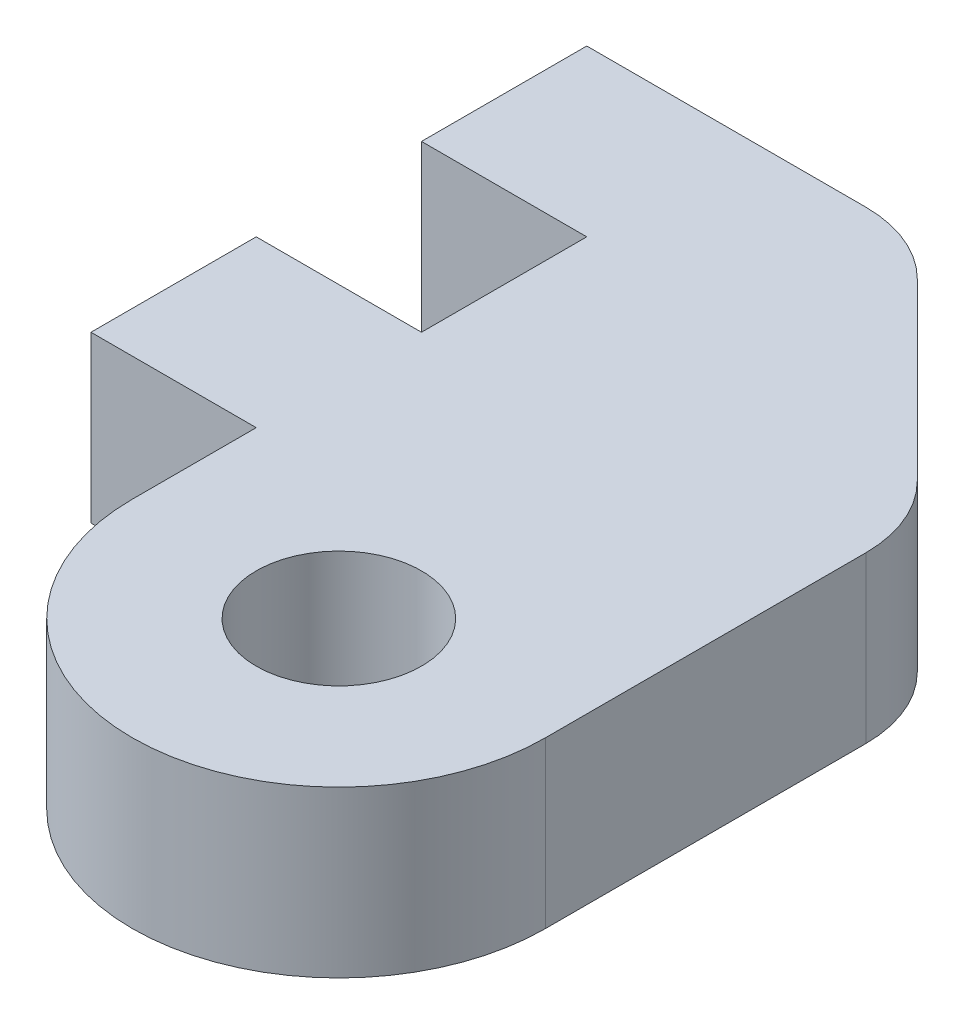
ISO-10303-21;
HEADER;
FILE_DESCRIPTION(('STEP AP214'),'2;1');
FILE_NAME('part.step','',(''),(''),'','','');
FILE_SCHEMA(('AUTOMOTIVE_DESIGN { 1 0 10303 214 1 1 1 1 }'));
ENDSEC;
DATA;
#1=APPLICATION_CONTEXT('core data for automotive mechanical design processes');
#2=APPLICATION_PROTOCOL_DEFINITION('international standard','automotive_design',2000,#1);
#3=PRODUCT_CONTEXT('',#1,'mechanical');
#4=PRODUCT('Part','Part','',(#3));
#5=PRODUCT_RELATED_PRODUCT_CATEGORY('part','',(#4));
#6=PRODUCT_DEFINITION_FORMATION('','',#4);
#7=PRODUCT_DEFINITION_CONTEXT('part definition',#1,'design');
#8=PRODUCT_DEFINITION('design','',#6,#7);
#9=PRODUCT_DEFINITION_SHAPE('','',#8);
#10=(LENGTH_UNIT() NAMED_UNIT(*) SI_UNIT(.MILLI.,.METRE.));
#11=(NAMED_UNIT(*) PLANE_ANGLE_UNIT() SI_UNIT($,.RADIAN.));
#12=(NAMED_UNIT(*) SI_UNIT($,.STERADIAN.) SOLID_ANGLE_UNIT());
#13=UNCERTAINTY_MEASURE_WITH_UNIT(LENGTH_MEASURE(1.E-05),#10,'distance_accuracy_value','');
#14=(GEOMETRIC_REPRESENTATION_CONTEXT(3) GLOBAL_UNCERTAINTY_ASSIGNED_CONTEXT((#13)) GLOBAL_UNIT_ASSIGNED_CONTEXT((#10,
#11,#12)) REPRESENTATION_CONTEXT('',''));
#15=CARTESIAN_POINT('',(0.,0.,0.));
#16=DIRECTION('',(0.,0.,1.));
#17=DIRECTION('',(1.,0.,0.));
#18=AXIS2_PLACEMENT_3D('',#15,#16,#17);
#19=CARTESIAN_POINT('',(0.,4.,-15.));
#20=DIRECTION('',(0.,0.,1.));
#21=DIRECTION('',(1.,0.,0.));
#22=AXIS2_PLACEMENT_3D('',#19,#20,#21);
#23=PLANE('',#22);
#24=DIRECTION('',(-1.,0.,0.));
#25=VECTOR('',#24,1.);
#26=CARTESIAN_POINT('',(0.,4.,-15.));
#27=LINE('',#26,#25);
#28=CARTESIAN_POINT('',(-2.24264068711929,4.,-15.));
#29=VERTEX_POINT('',#28);
#30=CARTESIAN_POINT('',(-9.,4.,-15.));
#31=VERTEX_POINT('',#30);
#32=EDGE_CURVE('E131',#29,#31,#27,.T.);
#33=ORIENTED_EDGE('',*,*,#32,.F.);
#34=DIRECTION('',(0.,1.,0.));
#35=VECTOR('',#34,1.);
#36=CARTESIAN_POINT('',(-2.24264068711929,0.,-15.));
#37=LINE('',#36,#35);
#38=CARTESIAN_POINT('',(-2.24264068711929,0.,-15.));
#39=VERTEX_POINT('',#38);
#40=EDGE_CURVE('E11',#29,#39,#37,.F.);
#41=ORIENTED_EDGE('',*,*,#40,.T.);
#42=DIRECTION('',(-1.,0.,0.));
#43=VECTOR('',#42,1.);
#44=CARTESIAN_POINT('',(0.,0.,-15.));
#45=LINE('',#44,#43);
#46=CARTESIAN_POINT('',(-9.,0.,-15.));
#47=VERTEX_POINT('',#46);
#48=EDGE_CURVE('E155',#39,#47,#45,.T.);
#49=ORIENTED_EDGE('',*,*,#48,.T.);
#50=DIRECTION('',(0.,-1.,0.));
#51=VECTOR('',#50,1.);
#52=CARTESIAN_POINT('',(-9.,4.,-15.));
#53=LINE('',#52,#51);
#54=EDGE_CURVE('E149',#31,#47,#53,.T.);
#55=ORIENTED_EDGE('',*,*,#54,.F.);
#56=EDGE_LOOP('',(#33,#41,#49,#55));
#57=FACE_BOUND('',#56,.T.);
#58=ADVANCED_FACE('F35',(#57),#23,.F.);
#59=CARTESIAN_POINT('',(-9.,4.,0.));
#60=DIRECTION('',(1.,0.,0.));
#61=DIRECTION('',(0.,0.,-1.));
#62=AXIS2_PLACEMENT_3D('',#59,#60,#61);
#63=PLANE('',#62);
#64=DIRECTION('',(0.,0.,1.));
#65=VECTOR('',#64,1.);
#66=CARTESIAN_POINT('',(-9.,0.,0.));
#67=LINE('',#66,#65);
#68=CARTESIAN_POINT('',(-9.,0.,-11.));
#69=VERTEX_POINT('',#68);
#70=EDGE_CURVE('E196',#47,#69,#67,.T.);
#71=ORIENTED_EDGE('',*,*,#70,.T.);
#72=DIRECTION('',(0.,-1.,0.));
#73=VECTOR('',#72,1.);
#74=CARTESIAN_POINT('',(-9.,4.,-11.));
#75=LINE('',#74,#73);
#76=CARTESIAN_POINT('',(-9.,4.,-11.));
#77=VERTEX_POINT('',#76);
#78=EDGE_CURVE('E150',#77,#69,#75,.T.);
#79=ORIENTED_EDGE('',*,*,#78,.F.);
#80=DIRECTION('',(0.,0.,1.));
#81=VECTOR('',#80,1.);
#82=CARTESIAN_POINT('',(-9.,4.,0.));
#83=LINE('',#82,#81);
#84=EDGE_CURVE('E136',#31,#77,#83,.T.);
#85=ORIENTED_EDGE('',*,*,#84,.F.);
#86=ORIENTED_EDGE('',*,*,#54,.T.);
#87=EDGE_LOOP('',(#71,#79,#85,#86));
#88=FACE_BOUND('',#87,.T.);
#89=ADVANCED_FACE('F148',(#88),#63,.F.);
#90=CARTESIAN_POINT('',(0.,4.,-11.));
#91=DIRECTION('',(0.,0.,1.));
#92=DIRECTION('',(1.,0.,0.));
#93=AXIS2_PLACEMENT_3D('',#90,#91,#92);
#94=PLANE('',#93);
#95=DIRECTION('',(-1.,0.,0.));
#96=VECTOR('',#95,1.);
#97=CARTESIAN_POINT('',(0.,0.,-11.));
#98=LINE('',#97,#96);
#99=CARTESIAN_POINT('',(-5.,0.,-11.));
#100=VERTEX_POINT('',#99);
#101=EDGE_CURVE('E199',#100,#69,#98,.T.);
#102=ORIENTED_EDGE('',*,*,#101,.F.);
#103=DIRECTION('',(0.,-1.,0.));
#104=VECTOR('',#103,1.);
#105=CARTESIAN_POINT('',(-5.,4.,-11.));
#106=LINE('',#105,#104);
#107=CARTESIAN_POINT('',(-5.,4.,-11.));
#108=VERTEX_POINT('',#107);
#109=EDGE_CURVE('E161',#108,#100,#106,.T.);
#110=ORIENTED_EDGE('',*,*,#109,.F.);
#111=DIRECTION('',(-1.,0.,0.));
#112=VECTOR('',#111,1.);
#113=CARTESIAN_POINT('',(0.,4.,-11.));
#114=LINE('',#113,#112);
#115=EDGE_CURVE('E152',#108,#77,#114,.T.);
#116=ORIENTED_EDGE('',*,*,#115,.T.);
#117=ORIENTED_EDGE('',*,*,#78,.T.);
#118=EDGE_LOOP('',(#102,#110,#116,#117));
#119=FACE_BOUND('',#118,.T.);
#120=ADVANCED_FACE('F238',(#119),#94,.T.);
#121=CARTESIAN_POINT('',(-5.,4.,0.));
#122=DIRECTION('',(-1.,0.,0.));
#123=DIRECTION('',(0.,0.,1.));
#124=AXIS2_PLACEMENT_3D('',#121,#122,#123);
#125=PLANE('',#124);
#126=DIRECTION('',(0.,0.,-1.));
#127=VECTOR('',#126,1.);
#128=CARTESIAN_POINT('',(-5.,0.,0.));
#129=LINE('',#128,#127);
#130=CARTESIAN_POINT('',(-5.,0.,-7.));
#131=VERTEX_POINT('',#130);
#132=EDGE_CURVE('E206',#131,#100,#129,.T.);
#133=ORIENTED_EDGE('',*,*,#132,.F.);
#134=DIRECTION('',(0.,-1.,0.));
#135=VECTOR('',#134,1.);
#136=CARTESIAN_POINT('',(-5.,4.,-7.));
#137=LINE('',#136,#135);
#138=CARTESIAN_POINT('',(-5.,4.,-7.));
#139=VERTEX_POINT('',#138);
#140=EDGE_CURVE('E229',#139,#131,#137,.T.);
#141=ORIENTED_EDGE('',*,*,#140,.F.);
#142=DIRECTION('',(0.,0.,-1.));
#143=VECTOR('',#142,1.);
#144=CARTESIAN_POINT('',(-5.,4.,0.));
#145=LINE('',#144,#143);
#146=EDGE_CURVE('E236',#139,#108,#145,.T.);
#147=ORIENTED_EDGE('',*,*,#146,.T.);
#148=ORIENTED_EDGE('',*,*,#109,.T.);
#149=EDGE_LOOP('',(#133,#141,#147,#148));
#150=FACE_BOUND('',#149,.T.);
#151=ADVANCED_FACE('F234',(#150),#125,.T.);
#152=CARTESIAN_POINT('',(0.,4.,-7.));
#153=DIRECTION('',(0.,0.,1.));
#154=DIRECTION('',(1.,0.,0.));
#155=AXIS2_PLACEMENT_3D('',#152,#153,#154);
#156=PLANE('',#155);
#157=DIRECTION('',(-1.,0.,0.));
#158=VECTOR('',#157,1.);
#159=CARTESIAN_POINT('',(0.,0.,-7.));
#160=LINE('',#159,#158);
#161=CARTESIAN_POINT('',(-9.,0.,-7.));
#162=VERTEX_POINT('',#161);
#163=EDGE_CURVE('E209',#131,#162,#160,.T.);
#164=ORIENTED_EDGE('',*,*,#163,.T.);
#165=DIRECTION('',(0.,-1.,0.));
#166=VECTOR('',#165,1.);
#167=CARTESIAN_POINT('',(-9.,4.,-7.));
#168=LINE('',#167,#166);
#169=CARTESIAN_POINT('',(-9.,4.,-7.));
#170=VERTEX_POINT('',#169);
#171=EDGE_CURVE('E226',#170,#162,#168,.T.);
#172=ORIENTED_EDGE('',*,*,#171,.F.);
#173=DIRECTION('',(-1.,0.,0.));
#174=VECTOR('',#173,1.);
#175=CARTESIAN_POINT('',(0.,4.,-7.));
#176=LINE('',#175,#174);
#177=EDGE_CURVE('E253',#139,#170,#176,.T.);
#178=ORIENTED_EDGE('',*,*,#177,.F.);
#179=ORIENTED_EDGE('',*,*,#140,.T.);
#180=EDGE_LOOP('',(#164,#172,#178,#179));
#181=FACE_BOUND('',#180,.T.);
#182=ADVANCED_FACE('F243',(#181),#156,.F.);
#183=CARTESIAN_POINT('',(-9.,4.,0.));
#184=DIRECTION('',(1.,0.,0.));
#185=DIRECTION('',(0.,0.,-1.));
#186=AXIS2_PLACEMENT_3D('',#183,#184,#185);
#187=PLANE('',#186);
#188=DIRECTION('',(0.,0.,1.));
#189=VECTOR('',#188,1.);
#190=CARTESIAN_POINT('',(-9.,0.,0.));
#191=LINE('',#190,#189);
#192=CARTESIAN_POINT('',(-9.,0.,-3.));
#193=VERTEX_POINT('',#192);
#194=EDGE_CURVE('E212',#162,#193,#191,.T.);
#195=ORIENTED_EDGE('',*,*,#194,.T.);
#196=DIRECTION('',(0.,-1.,0.));
#197=VECTOR('',#196,1.);
#198=CARTESIAN_POINT('',(-9.,4.,-3.));
#199=LINE('',#198,#197);
#200=CARTESIAN_POINT('',(-9.,4.,-3.));
#201=VERTEX_POINT('',#200);
#202=EDGE_CURVE('E224',#201,#193,#199,.T.);
#203=ORIENTED_EDGE('',*,*,#202,.F.);
#204=DIRECTION('',(0.,0.,1.));
#205=VECTOR('',#204,1.);
#206=CARTESIAN_POINT('',(-9.,4.,0.));
#207=LINE('',#206,#205);
#208=EDGE_CURVE('E249',#170,#201,#207,.T.);
#209=ORIENTED_EDGE('',*,*,#208,.F.);
#210=ORIENTED_EDGE('',*,*,#171,.T.);
#211=EDGE_LOOP('',(#195,#203,#209,#210));
#212=FACE_BOUND('',#211,.T.);
#213=ADVANCED_FACE('F247',(#212),#187,.F.);
#214=CARTESIAN_POINT('',(0.,4.,-3.));
#215=DIRECTION('',(0.,0.,1.));
#216=DIRECTION('',(1.,0.,0.));
#217=AXIS2_PLACEMENT_3D('',#214,#215,#216);
#218=PLANE('',#217);
#219=DIRECTION('',(-1.,0.,0.));
#220=VECTOR('',#219,1.);
#221=CARTESIAN_POINT('',(0.,0.,-3.));
#222=LINE('',#221,#220);
#223=CARTESIAN_POINT('',(-5.,0.,-3.));
#224=VERTEX_POINT('',#223);
#225=EDGE_CURVE('E215',#224,#193,#222,.T.);
#226=ORIENTED_EDGE('',*,*,#225,.F.);
#227=DIRECTION('',(0.,-1.,0.));
#228=VECTOR('',#227,1.);
#229=CARTESIAN_POINT('',(-5.,4.,-3.));
#230=LINE('',#229,#228);
#231=CARTESIAN_POINT('',(-5.,4.,-3.));
#232=VERTEX_POINT('',#231);
#233=EDGE_CURVE('E222',#232,#224,#230,.T.);
#234=ORIENTED_EDGE('',*,*,#233,.F.);
#235=DIRECTION('',(-1.,0.,0.));
#236=VECTOR('',#235,1.);
#237=CARTESIAN_POINT('',(0.,4.,-3.));
#238=LINE('',#237,#236);
#239=EDGE_CURVE('E252',#232,#201,#238,.T.);
#240=ORIENTED_EDGE('',*,*,#239,.T.);
#241=ORIENTED_EDGE('',*,*,#202,.T.);
#242=EDGE_LOOP('',(#226,#234,#240,#241));
#243=FACE_BOUND('',#242,.T.);
#244=ADVANCED_FACE('F364',(#243),#218,.T.);
#245=CARTESIAN_POINT('',(-5.,0.,0.));
#246=VERTEX_POINT('',#245);
#247=EDGE_CURVE('E210',#246,#224,#129,.T.);
#248=ORIENTED_EDGE('',*,*,#247,.F.);
#249=DIRECTION('',(0.,-1.,0.));
#250=VECTOR('',#249,1.);
#251=CARTESIAN_POINT('',(-5.,4.,0.));
#252=LINE('',#251,#250);
#253=CARTESIAN_POINT('',(-5.,4.,0.));
#254=VERTEX_POINT('',#253);
#255=EDGE_CURVE('E220',#254,#246,#252,.T.);
#256=ORIENTED_EDGE('',*,*,#255,.F.);
#257=EDGE_CURVE('E255',#254,#232,#145,.T.);
#258=ORIENTED_EDGE('',*,*,#257,.T.);
#259=ORIENTED_EDGE('',*,*,#233,.T.);
#260=EDGE_LOOP('',(#248,#256,#258,#259));
#261=FACE_BOUND('',#260,.T.);
#262=ADVANCED_FACE('F354',(#261),#125,.T.);
#263=CARTESIAN_POINT('',(0.,4.,0.));
#264=DIRECTION('',(0.,-1.,0.));
#265=DIRECTION('',(0.,0.,-1.));
#266=AXIS2_PLACEMENT_3D('',#263,#264,#265);
#267=CYLINDRICAL_SURFACE('',#266,5.);
#268=CARTESIAN_POINT('',(0.,0.,0.));
#269=DIRECTION('',(0.,1.,0.));
#270=DIRECTION('',(0.,0.,1.));
#271=AXIS2_PLACEMENT_3D('',#268,#269,#270);
#272=CIRCLE('',#271,5.);
#273=CARTESIAN_POINT('',(5.,0.,0.));
#274=VERTEX_POINT('',#273);
#275=EDGE_CURVE('E190',#246,#274,#272,.T.);
#276=ORIENTED_EDGE('',*,*,#275,.T.);
#277=DIRECTION('',(0.,-1.,0.));
#278=VECTOR('',#277,1.);
#279=CARTESIAN_POINT('',(5.,4.,0.));
#280=LINE('',#279,#278);
#281=CARTESIAN_POINT('',(5.,4.,0.));
#282=VERTEX_POINT('',#281);
#283=EDGE_CURVE('E189',#282,#274,#280,.T.);
#284=ORIENTED_EDGE('',*,*,#283,.F.);
#285=CARTESIAN_POINT('',(0.,4.,0.));
#286=DIRECTION('',(0.,1.,0.));
#287=DIRECTION('',(0.,0.,1.));
#288=AXIS2_PLACEMENT_3D('',#285,#286,#287);
#289=CIRCLE('',#288,5.);
#290=EDGE_CURVE('E260',#254,#282,#289,.T.);
#291=ORIENTED_EDGE('',*,*,#290,.F.);
#292=ORIENTED_EDGE('',*,*,#255,.T.);
#293=EDGE_LOOP('',(#276,#284,#291,#292));
#294=FACE_BOUND('',#293,.T.);
#295=ADVANCED_FACE('F292',(#294),#267,.T.);
#296=CARTESIAN_POINT('',(0.,4.,0.));
#297=DIRECTION('',(0.,-1.,0.));
#298=DIRECTION('',(0.,0.,-1.));
#299=AXIS2_PLACEMENT_3D('',#296,#297,#298);
#300=CYLINDRICAL_SURFACE('',#299,2.);
#301=CARTESIAN_POINT('',(0.,4.,0.));
#302=DIRECTION('',(0.,1.,0.));
#303=DIRECTION('',(0.,0.,1.));
#304=AXIS2_PLACEMENT_3D('',#301,#302,#303);
#305=CIRCLE('',#304,2.);
#306=CARTESIAN_POINT('',(0.,4.,2.));
#307=VERTEX_POINT('',#306);
#308=EDGE_CURVE('E143',#307,#307,#305,.T.);
#309=ORIENTED_EDGE('',*,*,#308,.T.);
#310=EDGE_LOOP('',(#309));
#311=FACE_BOUND('',#310,.T.);
#312=CARTESIAN_POINT('',(0.,0.,0.));
#313=DIRECTION('',(0.,1.,0.));
#314=DIRECTION('',(0.,0.,1.));
#315=AXIS2_PLACEMENT_3D('',#312,#313,#314);
#316=CIRCLE('',#315,2.);
#317=CARTESIAN_POINT('',(0.,0.,2.));
#318=VERTEX_POINT('',#317);
#319=EDGE_CURVE('E197',#318,#318,#316,.T.);
#320=ORIENTED_EDGE('',*,*,#319,.F.);
#321=EDGE_LOOP('',(#320));
#322=FACE_BOUND('',#321,.T.);
#323=ADVANCED_FACE('F270',(#311,#322),#300,.F.);
#324=CARTESIAN_POINT('',(5.,4.,0.));
#325=DIRECTION('',(-1.,0.,0.));
#326=DIRECTION('',(0.,0.,1.));
#327=AXIS2_PLACEMENT_3D('',#324,#325,#326);
#328=PLANE('',#327);
#329=DIRECTION('',(0.,0.,-1.));
#330=VECTOR('',#329,1.);
#331=CARTESIAN_POINT('',(5.,0.,0.));
#332=LINE('',#331,#330);
#333=CARTESIAN_POINT('',(5.,0.,-7.7573593128807));
#334=VERTEX_POINT('',#333);
#335=EDGE_CURVE('E181',#274,#334,#332,.T.);
#336=ORIENTED_EDGE('',*,*,#335,.T.);
#337=DIRECTION('',(0.,-1.,0.));
#338=VECTOR('',#337,1.);
#339=CARTESIAN_POINT('',(5.,4.,-7.7573593128807));
#340=LINE('',#339,#338);
#341=CARTESIAN_POINT('',(5.,4.,-7.7573593128807));
#342=VERTEX_POINT('',#341);
#343=EDGE_CURVE('E166',#334,#342,#340,.F.);
#344=ORIENTED_EDGE('',*,*,#343,.T.);
#345=DIRECTION('',(0.,0.,-1.));
#346=VECTOR('',#345,1.);
#347=CARTESIAN_POINT('',(5.,4.,0.));
#348=LINE('',#347,#346);
#349=EDGE_CURVE('E193',#282,#342,#348,.T.);
#350=ORIENTED_EDGE('',*,*,#349,.F.);
#351=ORIENTED_EDGE('',*,*,#283,.T.);
#352=EDGE_LOOP('',(#336,#344,#350,#351));
#353=FACE_BOUND('',#352,.T.);
#354=ADVANCED_FACE('F186',(#353),#328,.F.);
#355=CARTESIAN_POINT('',(0.,4.,0.));
#356=DIRECTION('',(0.,1.,0.));
#357=DIRECTION('',(0.,0.,1.));
#358=AXIS2_PLACEMENT_3D('',#355,#356,#357);
#359=PLANE('',#358);
#360=ORIENTED_EDGE('',*,*,#308,.F.);
#361=EDGE_LOOP('',(#360));
#362=FACE_BOUND('',#361,.T.);
#363=ORIENTED_EDGE('',*,*,#349,.T.);
#364=CARTESIAN_POINT('',(2.,4.,-7.7573593128807));
#365=DIRECTION('',(0.,1.,0.));
#366=DIRECTION('',(0.,0.,1.));
#367=AXIS2_PLACEMENT_3D('',#364,#365,#366);
#368=CIRCLE('',#367,3.);
#369=CARTESIAN_POINT('',(4.12132034355965,4.,-9.87867965644034));
#370=VERTEX_POINT('',#369);
#371=EDGE_CURVE('E170',#342,#370,#368,.T.);
#372=ORIENTED_EDGE('',*,*,#371,.T.);
#373=DIRECTION('',(0.707106781186546,0.,0.707106781186549));
#374=VECTOR('',#373,1.);
#375=CARTESIAN_POINT('',(7.,4.,-6.99999999999997));
#376=LINE('',#375,#374);
#377=CARTESIAN_POINT('',(-0.121320343559639,4.,-14.1213203435596));
#378=VERTEX_POINT('',#377);
#379=EDGE_CURVE('E159',#370,#378,#376,.F.);
#380=ORIENTED_EDGE('',*,*,#379,.T.);
#381=CARTESIAN_POINT('',(-2.24264068711929,4.,-12.));
#382=DIRECTION('',(0.,1.,0.));
#383=DIRECTION('',(0.,0.,1.));
#384=AXIS2_PLACEMENT_3D('',#381,#382,#383);
#385=CIRCLE('',#384,3.);
#386=EDGE_CURVE('E140',#378,#29,#385,.T.);
#387=ORIENTED_EDGE('',*,*,#386,.T.);
#388=ORIENTED_EDGE('',*,*,#32,.T.);
#389=ORIENTED_EDGE('',*,*,#84,.T.);
#390=ORIENTED_EDGE('',*,*,#115,.F.);
#391=ORIENTED_EDGE('',*,*,#146,.F.);
#392=ORIENTED_EDGE('',*,*,#177,.T.);
#393=ORIENTED_EDGE('',*,*,#208,.T.);
#394=ORIENTED_EDGE('',*,*,#239,.F.);
#395=ORIENTED_EDGE('',*,*,#257,.F.);
#396=ORIENTED_EDGE('',*,*,#290,.T.);
#397=EDGE_LOOP('',(#363,#372,#380,#387,#388,#389,#390,#391,#392,#393,#394,#395,#396));
#398=FACE_BOUND('',#397,.T.);
#399=ADVANCED_FACE('F134',(#362,#398),#359,.T.);
#400=CARTESIAN_POINT('',(0.,0.,0.));
#401=DIRECTION('',(0.,1.,0.));
#402=DIRECTION('',(0.,0.,1.));
#403=AXIS2_PLACEMENT_3D('',#400,#401,#402);
#404=PLANE('',#403);
#405=ORIENTED_EDGE('',*,*,#319,.T.);
#406=EDGE_LOOP('',(#405));
#407=FACE_BOUND('',#406,.T.);
#408=DIRECTION('',(-0.707106781186546,0.,-0.707106781186549));
#409=VECTOR('',#408,1.);
#410=CARTESIAN_POINT('',(-0.999999999999995,0.,-15.));
#411=LINE('',#410,#409);
#412=CARTESIAN_POINT('',(-0.121320343559637,0.,-14.1213203435596));
#413=VERTEX_POINT('',#412);
#414=CARTESIAN_POINT('',(4.12132034355965,0.,-9.87867965644033));
#415=VERTEX_POINT('',#414);
#416=EDGE_CURVE('E157',#413,#415,#411,.F.);
#417=ORIENTED_EDGE('',*,*,#416,.T.);
#418=CARTESIAN_POINT('',(2.,0.,-7.7573593128807));
#419=DIRECTION('',(0.,1.,0.));
#420=DIRECTION('',(0.,0.,1.));
#421=AXIS2_PLACEMENT_3D('',#418,#419,#420);
#422=CIRCLE('',#421,3.);
#423=EDGE_CURVE('E43',#415,#334,#422,.F.);
#424=ORIENTED_EDGE('',*,*,#423,.T.);
#425=ORIENTED_EDGE('',*,*,#335,.F.);
#426=ORIENTED_EDGE('',*,*,#275,.F.);
#427=ORIENTED_EDGE('',*,*,#247,.T.);
#428=ORIENTED_EDGE('',*,*,#225,.T.);
#429=ORIENTED_EDGE('',*,*,#194,.F.);
#430=ORIENTED_EDGE('',*,*,#163,.F.);
#431=ORIENTED_EDGE('',*,*,#132,.T.);
#432=ORIENTED_EDGE('',*,*,#101,.T.);
#433=ORIENTED_EDGE('',*,*,#70,.F.);
#434=ORIENTED_EDGE('',*,*,#48,.F.);
#435=CARTESIAN_POINT('',(-2.24264068711929,0.,-12.));
#436=DIRECTION('',(0.,1.,0.));
#437=DIRECTION('',(0.,0.,1.));
#438=AXIS2_PLACEMENT_3D('',#435,#436,#437);
#439=CIRCLE('',#438,3.);
#440=EDGE_CURVE('E50',#39,#413,#439,.F.);
#441=ORIENTED_EDGE('',*,*,#440,.T.);
#442=EDGE_LOOP('',(#417,#424,#425,#426,#427,#428,#429,#430,#431,#432,#433,#434,#441));
#443=FACE_BOUND('',#442,.T.);
#444=ADVANCED_FACE('F179',(#407,#443),#404,.F.);
#445=CARTESIAN_POINT('',(-0.999999999999995,4.,-15.));
#446=DIRECTION('',(-0.707106781186549,0.,0.707106781186546));
#447=DIRECTION('',(0.,-1.,0.));
#448=AXIS2_PLACEMENT_3D('',#445,#446,#447);
#449=PLANE('',#448);
#450=ORIENTED_EDGE('',*,*,#379,.F.);
#451=DIRECTION('',(0.,1.,0.));
#452=VECTOR('',#451,1.);
#453=CARTESIAN_POINT('',(4.12132034355965,0.,-9.87867965644034));
#454=LINE('',#453,#452);
#455=EDGE_CURVE('E57',#370,#415,#454,.F.);
#456=ORIENTED_EDGE('',*,*,#455,.T.);
#457=ORIENTED_EDGE('',*,*,#416,.F.);
#458=DIRECTION('',(0.,-1.,0.));
#459=VECTOR('',#458,1.);
#460=CARTESIAN_POINT('',(-0.121320343559638,4.,-14.1213203435596));
#461=LINE('',#460,#459);
#462=EDGE_CURVE('E172',#413,#378,#461,.F.);
#463=ORIENTED_EDGE('',*,*,#462,.T.);
#464=EDGE_LOOP('',(#450,#456,#457,#463));
#465=FACE_BOUND('',#464,.T.);
#466=ADVANCED_FACE('F194',(#465),#449,.F.);
#467=CARTESIAN_POINT('',(2.,4.,-7.7573593128807));
#468=DIRECTION('',(0.,1.,0.));
#469=DIRECTION('',(0.,0.,1.));
#470=AXIS2_PLACEMENT_3D('',#467,#468,#469);
#471=CYLINDRICAL_SURFACE('',#470,3.);
#472=ORIENTED_EDGE('',*,*,#423,.F.);
#473=ORIENTED_EDGE('',*,*,#455,.F.);
#474=ORIENTED_EDGE('',*,*,#371,.F.);
#475=ORIENTED_EDGE('',*,*,#343,.F.);
#476=EDGE_LOOP('',(#472,#473,#474,#475));
#477=FACE_BOUND('',#476,.T.);
#478=ADVANCED_FACE('F192',(#477),#471,.T.);
#479=CARTESIAN_POINT('',(-2.24264068711929,4.,-12.));
#480=DIRECTION('',(0.,-1.,0.));
#481=DIRECTION('',(0.,0.,-1.));
#482=AXIS2_PLACEMENT_3D('',#479,#480,#481);
#483=CYLINDRICAL_SURFACE('',#482,3.);
#484=ORIENTED_EDGE('',*,*,#386,.F.);
#485=ORIENTED_EDGE('',*,*,#462,.F.);
#486=ORIENTED_EDGE('',*,*,#440,.F.);
#487=ORIENTED_EDGE('',*,*,#40,.F.);
#488=EDGE_LOOP('',(#484,#485,#486,#487));
#489=FACE_BOUND('',#488,.T.);
#490=ADVANCED_FACE('F37',(#489),#483,.T.);
#491=CLOSED_SHELL('',(#58,#89,#120,#151,#182,#213,#244,#262,#295,#323,#354,#399,#444,#466,#478,#490));
#492=MANIFOLD_SOLID_BREP('B2',#491);
#493=ADVANCED_BREP_SHAPE_REPRESENTATION('',(#18,#492),#14);
#494=SHAPE_DEFINITION_REPRESENTATION(#9,#493);
ENDSEC;
END-ISO-10303-21;
